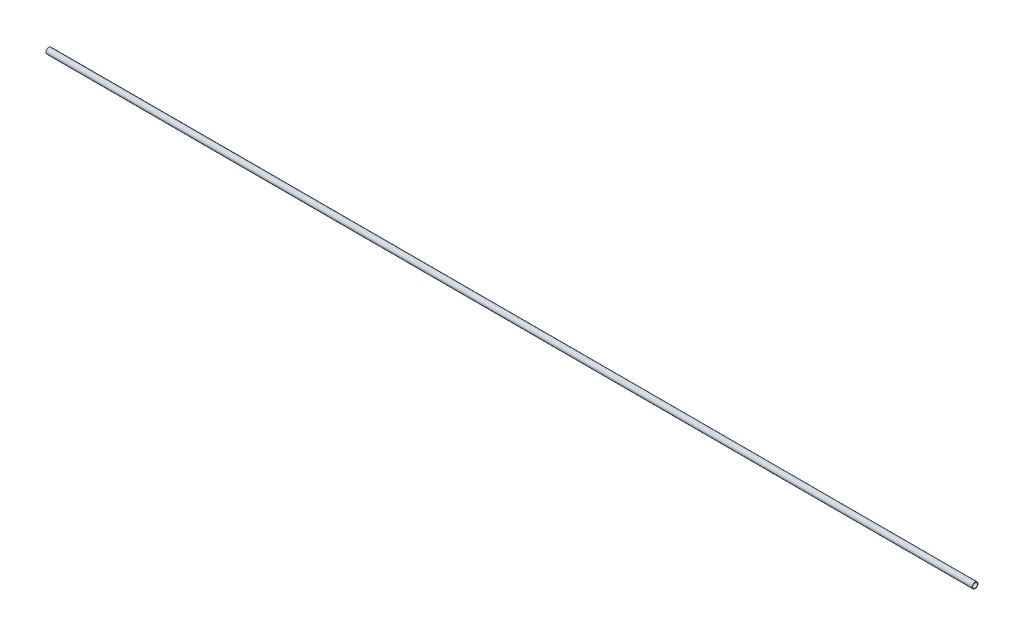
ISO-10303-21;
HEADER;
FILE_DESCRIPTION(('STEP AP214'),'2;1');
FILE_NAME('part.step','',(''),(''),'','','');
FILE_SCHEMA(('AUTOMOTIVE_DESIGN { 1 0 10303 214 1 1 1 1 }'));
ENDSEC;
DATA;
#1=APPLICATION_CONTEXT('core data for automotive mechanical design processes');
#2=APPLICATION_PROTOCOL_DEFINITION('international standard','automotive_design',2000,#1);
#3=PRODUCT_CONTEXT('',#1,'mechanical');
#4=PRODUCT('Part','Part','',(#3));
#5=PRODUCT_RELATED_PRODUCT_CATEGORY('part','',(#4));
#6=PRODUCT_DEFINITION_FORMATION('','',#4);
#7=PRODUCT_DEFINITION_CONTEXT('part definition',#1,'design');
#8=PRODUCT_DEFINITION('design','',#6,#7);
#9=PRODUCT_DEFINITION_SHAPE('','',#8);
#10=(LENGTH_UNIT() NAMED_UNIT(*) SI_UNIT(.MILLI.,.METRE.));
#11=(NAMED_UNIT(*) PLANE_ANGLE_UNIT() SI_UNIT($,.RADIAN.));
#12=(NAMED_UNIT(*) SI_UNIT($,.STERADIAN.) SOLID_ANGLE_UNIT());
#13=UNCERTAINTY_MEASURE_WITH_UNIT(LENGTH_MEASURE(1.E-05),#10,'distance_accuracy_value','');
#14=(GEOMETRIC_REPRESENTATION_CONTEXT(3) GLOBAL_UNCERTAINTY_ASSIGNED_CONTEXT((#13)) GLOBAL_UNIT_ASSIGNED_CONTEXT((#10,
#11,#12)) REPRESENTATION_CONTEXT('',''));
#15=CARTESIAN_POINT('',(0.,0.,0.));
#16=DIRECTION('',(0.,0.,1.));
#17=DIRECTION('',(1.,0.,0.));
#18=AXIS2_PLACEMENT_3D('',#15,#16,#17);
#19=CARTESIAN_POINT('',(1219.2,0.,0.));
#20=DIRECTION('',(-1.,0.,0.));
#21=DIRECTION('',(0.,0.,1.));
#22=AXIS2_PLACEMENT_3D('',#19,#20,#21);
#23=CYLINDRICAL_SURFACE('',#22,3.81);
#24=CARTESIAN_POINT('',(1219.2,0.,0.));
#25=DIRECTION('',(1.,0.,0.));
#26=DIRECTION('',(0.,0.,-1.));
#27=AXIS2_PLACEMENT_3D('',#24,#25,#26);
#28=CIRCLE('',#27,3.81);
#29=CARTESIAN_POINT('',(1219.2,0.,-3.81));
#30=VERTEX_POINT('',#29);
#31=EDGE_CURVE('E10',#30,#30,#28,.T.);
#32=ORIENTED_EDGE('',*,*,#31,.F.);
#33=EDGE_LOOP('',(#32));
#34=FACE_BOUND('',#33,.T.);
#35=CARTESIAN_POINT('',(0.,0.,0.));
#36=DIRECTION('',(1.,0.,0.));
#37=DIRECTION('',(0.,0.,-1.));
#38=AXIS2_PLACEMENT_3D('',#35,#36,#37);
#39=CIRCLE('',#38,3.81);
#40=CARTESIAN_POINT('',(0.,0.,-3.81));
#41=VERTEX_POINT('',#40);
#42=EDGE_CURVE('E33',#41,#41,#39,.T.);
#43=ORIENTED_EDGE('',*,*,#42,.T.);
#44=EDGE_LOOP('',(#43));
#45=FACE_BOUND('',#44,.T.);
#46=ADVANCED_FACE('F30',(#34,#45),#23,.T.);
#47=CARTESIAN_POINT('',(1219.2,0.,0.));
#48=DIRECTION('',(1.,0.,0.));
#49=DIRECTION('',(0.,0.,-1.));
#50=AXIS2_PLACEMENT_3D('',#47,#48,#49);
#51=PLANE('',#50);
#52=CARTESIAN_POINT('',(1219.2,0.,0.));
#53=DIRECTION('',(-1.,0.,0.));
#54=DIRECTION('',(0.,0.,1.));
#55=AXIS2_PLACEMENT_3D('',#52,#53,#54);
#56=CIRCLE('',#55,3.175);
#57=CARTESIAN_POINT('',(1219.2,0.,3.175));
#58=VERTEX_POINT('',#57);
#59=EDGE_CURVE('E40',#58,#58,#56,.T.);
#60=ORIENTED_EDGE('',*,*,#59,.T.);
#61=EDGE_LOOP('',(#60));
#62=FACE_BOUND('',#61,.T.);
#63=ORIENTED_EDGE('',*,*,#31,.T.);
#64=EDGE_LOOP('',(#63));
#65=FACE_BOUND('',#64,.T.);
#66=ADVANCED_FACE('F48',(#62,#65),#51,.T.);
#67=CARTESIAN_POINT('',(0.,0.,0.));
#68=DIRECTION('',(1.,0.,0.));
#69=DIRECTION('',(0.,0.,-1.));
#70=AXIS2_PLACEMENT_3D('',#67,#68,#69);
#71=PLANE('',#70);
#72=CARTESIAN_POINT('',(0.,0.,0.));
#73=DIRECTION('',(-1.,0.,0.));
#74=DIRECTION('',(0.,0.,1.));
#75=AXIS2_PLACEMENT_3D('',#72,#73,#74);
#76=CIRCLE('',#75,3.175);
#77=CARTESIAN_POINT('',(0.,0.,3.175));
#78=VERTEX_POINT('',#77);
#79=EDGE_CURVE('E42',#78,#78,#76,.T.);
#80=ORIENTED_EDGE('',*,*,#79,.F.);
#81=EDGE_LOOP('',(#80));
#82=FACE_BOUND('',#81,.T.);
#83=ORIENTED_EDGE('',*,*,#42,.F.);
#84=EDGE_LOOP('',(#83));
#85=FACE_BOUND('',#84,.T.);
#86=ADVANCED_FACE('F53',(#82,#85),#71,.F.);
#87=CARTESIAN_POINT('',(1219.2,0.,0.));
#88=DIRECTION('',(-1.,0.,0.));
#89=DIRECTION('',(0.,0.,1.));
#90=AXIS2_PLACEMENT_3D('',#87,#88,#89);
#91=CYLINDRICAL_SURFACE('',#90,3.175);
#92=ORIENTED_EDGE('',*,*,#59,.F.);
#93=EDGE_LOOP('',(#92));
#94=FACE_BOUND('',#93,.T.);
#95=ORIENTED_EDGE('',*,*,#79,.T.);
#96=EDGE_LOOP('',(#95));
#97=FACE_BOUND('',#96,.T.);
#98=ADVANCED_FACE('F50',(#94,#97),#91,.F.);
#99=CLOSED_SHELL('',(#46,#66,#86,#98));
#100=MANIFOLD_SOLID_BREP('B2',#99);
#101=ADVANCED_BREP_SHAPE_REPRESENTATION('',(#18,#100),#14);
#102=SHAPE_DEFINITION_REPRESENTATION(#9,#101);
ENDSEC;
END-ISO-10303-21;
